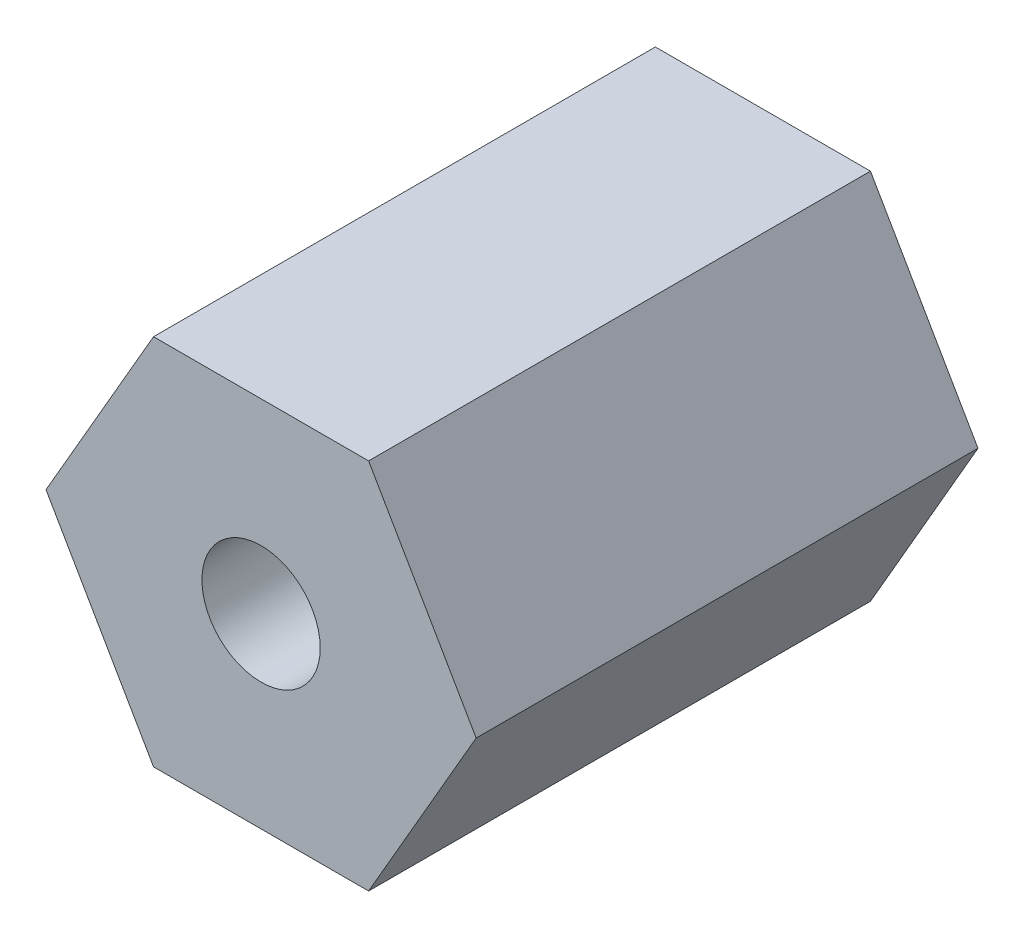
ISO-10303-21;
HEADER;
FILE_DESCRIPTION(('STEP AP214'),'2;1');
FILE_NAME('part.step','',(''),(''),'','','');
FILE_SCHEMA(('AUTOMOTIVE_DESIGN { 1 0 10303 214 1 1 1 1 }'));
ENDSEC;
DATA;
#1=APPLICATION_CONTEXT('core data for automotive mechanical design processes');
#2=APPLICATION_PROTOCOL_DEFINITION('international standard','automotive_design',2000,#1);
#3=PRODUCT_CONTEXT('',#1,'mechanical');
#4=PRODUCT('Part','Part','',(#3));
#5=PRODUCT_RELATED_PRODUCT_CATEGORY('part','',(#4));
#6=PRODUCT_DEFINITION_FORMATION('','',#4);
#7=PRODUCT_DEFINITION_CONTEXT('part definition',#1,'design');
#8=PRODUCT_DEFINITION('design','',#6,#7);
#9=PRODUCT_DEFINITION_SHAPE('','',#8);
#10=(LENGTH_UNIT() NAMED_UNIT(*) SI_UNIT(.MILLI.,.METRE.));
#11=(NAMED_UNIT(*) PLANE_ANGLE_UNIT() SI_UNIT($,.RADIAN.));
#12=(NAMED_UNIT(*) SI_UNIT($,.STERADIAN.) SOLID_ANGLE_UNIT());
#13=UNCERTAINTY_MEASURE_WITH_UNIT(LENGTH_MEASURE(1.E-05),#10,'distance_accuracy_value','');
#14=(GEOMETRIC_REPRESENTATION_CONTEXT(3) GLOBAL_UNCERTAINTY_ASSIGNED_CONTEXT((#13)) GLOBAL_UNIT_ASSIGNED_CONTEXT((#10,
#11,#12)) REPRESENTATION_CONTEXT('',''));
#15=CARTESIAN_POINT('',(0.,0.,0.));
#16=DIRECTION('',(0.,0.,1.));
#17=DIRECTION('',(1.,0.,0.));
#18=AXIS2_PLACEMENT_3D('',#15,#16,#17);
#19=CARTESIAN_POINT('',(3.,5.19615242270663,14.));
#20=DIRECTION('',(0.,-1.,0.));
#21=DIRECTION('',(1.,0.,0.));
#22=AXIS2_PLACEMENT_3D('',#19,#20,#21);
#23=PLANE('',#22);
#24=DIRECTION('',(-1.,0.,0.));
#25=VECTOR('',#24,1.);
#26=CARTESIAN_POINT('',(3.,5.19615242270663,0.));
#27=LINE('',#26,#25);
#28=CARTESIAN_POINT('',(3.,5.19615242270663,0.));
#29=VERTEX_POINT('',#28);
#30=CARTESIAN_POINT('',(-3.,5.19615242270663,0.));
#31=VERTEX_POINT('',#30);
#32=EDGE_CURVE('E122',#29,#31,#27,.T.);
#33=ORIENTED_EDGE('',*,*,#32,.T.);
#34=DIRECTION('',(0.,0.,-1.));
#35=VECTOR('',#34,1.);
#36=CARTESIAN_POINT('',(-3.,5.19615242270663,14.));
#37=LINE('',#36,#35);
#38=CARTESIAN_POINT('',(-3.,5.19615242270663,14.));
#39=VERTEX_POINT('',#38);
#40=EDGE_CURVE('E11',#39,#31,#37,.T.);
#41=ORIENTED_EDGE('',*,*,#40,.F.);
#42=DIRECTION('',(-1.,0.,0.));
#43=VECTOR('',#42,1.);
#44=CARTESIAN_POINT('',(3.,5.19615242270663,14.));
#45=LINE('',#44,#43);
#46=CARTESIAN_POINT('',(3.,5.19615242270663,14.));
#47=VERTEX_POINT('',#46);
#48=EDGE_CURVE('E132',#47,#39,#45,.T.);
#49=ORIENTED_EDGE('',*,*,#48,.F.);
#50=DIRECTION('',(0.,0.,-1.));
#51=VECTOR('',#50,1.);
#52=CARTESIAN_POINT('',(3.,5.19615242270663,14.));
#53=LINE('',#52,#51);
#54=EDGE_CURVE('E118',#47,#29,#53,.T.);
#55=ORIENTED_EDGE('',*,*,#54,.T.);
#56=EDGE_LOOP('',(#33,#41,#49,#55));
#57=FACE_BOUND('',#56,.T.);
#58=ADVANCED_FACE('F37',(#57),#23,.F.);
#59=CARTESIAN_POINT('',(-3.,5.19615242270663,14.));
#60=DIRECTION('',(0.866025403784438,-0.5,0.));
#61=DIRECTION('',(0.5,0.866025403784438,0.));
#62=AXIS2_PLACEMENT_3D('',#59,#60,#61);
#63=PLANE('',#62);
#64=DIRECTION('',(-0.5,-0.866025403784438,0.));
#65=VECTOR('',#64,1.);
#66=CARTESIAN_POINT('',(-3.,5.19615242270663,0.));
#67=LINE('',#66,#65);
#68=CARTESIAN_POINT('',(-6.,0.,0.));
#69=VERTEX_POINT('',#68);
#70=EDGE_CURVE('E125',#31,#69,#67,.T.);
#71=ORIENTED_EDGE('',*,*,#70,.T.);
#72=DIRECTION('',(0.,0.,-1.));
#73=VECTOR('',#72,1.);
#74=CARTESIAN_POINT('',(-6.,0.,14.));
#75=LINE('',#74,#73);
#76=CARTESIAN_POINT('',(-6.,0.,14.));
#77=VERTEX_POINT('',#76);
#78=EDGE_CURVE('E46',#77,#69,#75,.T.);
#79=ORIENTED_EDGE('',*,*,#78,.F.);
#80=DIRECTION('',(-0.5,-0.866025403784438,0.));
#81=VECTOR('',#80,1.);
#82=CARTESIAN_POINT('',(-3.,5.19615242270663,14.));
#83=LINE('',#82,#81);
#84=EDGE_CURVE('E91',#39,#77,#83,.T.);
#85=ORIENTED_EDGE('',*,*,#84,.F.);
#86=ORIENTED_EDGE('',*,*,#40,.T.);
#87=EDGE_LOOP('',(#71,#79,#85,#86));
#88=FACE_BOUND('',#87,.T.);
#89=ADVANCED_FACE('F158',(#88),#63,.F.);
#90=CARTESIAN_POINT('',(-6.,0.,14.));
#91=DIRECTION('',(0.866025403784439,0.5,0.));
#92=DIRECTION('',(-0.5,0.866025403784439,0.));
#93=AXIS2_PLACEMENT_3D('',#90,#91,#92);
#94=PLANE('',#93);
#95=DIRECTION('',(0.5,-0.866025403784439,0.));
#96=VECTOR('',#95,1.);
#97=CARTESIAN_POINT('',(-6.,0.,0.));
#98=LINE('',#97,#96);
#99=CARTESIAN_POINT('',(-3.,-5.19615242270663,0.));
#100=VERTEX_POINT('',#99);
#101=EDGE_CURVE('E127',#69,#100,#98,.T.);
#102=ORIENTED_EDGE('',*,*,#101,.T.);
#103=DIRECTION('',(0.,0.,-1.));
#104=VECTOR('',#103,1.);
#105=CARTESIAN_POINT('',(-3.,-5.19615242270663,14.));
#106=LINE('',#105,#104);
#107=CARTESIAN_POINT('',(-3.,-5.19615242270663,14.));
#108=VERTEX_POINT('',#107);
#109=EDGE_CURVE('E113',#108,#100,#106,.T.);
#110=ORIENTED_EDGE('',*,*,#109,.F.);
#111=DIRECTION('',(0.5,-0.866025403784439,0.));
#112=VECTOR('',#111,1.);
#113=CARTESIAN_POINT('',(-6.,0.,14.));
#114=LINE('',#113,#112);
#115=EDGE_CURVE('E104',#77,#108,#114,.T.);
#116=ORIENTED_EDGE('',*,*,#115,.F.);
#117=ORIENTED_EDGE('',*,*,#78,.T.);
#118=EDGE_LOOP('',(#102,#110,#116,#117));
#119=FACE_BOUND('',#118,.T.);
#120=ADVANCED_FACE('F139',(#119),#94,.F.);
#121=CARTESIAN_POINT('',(-3.,-5.19615242270663,14.));
#122=DIRECTION('',(0.,1.,0.));
#123=DIRECTION('',(0.,0.,1.));
#124=AXIS2_PLACEMENT_3D('',#121,#122,#123);
#125=PLANE('',#124);
#126=DIRECTION('',(1.,0.,0.));
#127=VECTOR('',#126,1.);
#128=CARTESIAN_POINT('',(-3.,-5.19615242270663,0.));
#129=LINE('',#128,#127);
#130=CARTESIAN_POINT('',(3.,-5.19615242270663,0.));
#131=VERTEX_POINT('',#130);
#132=EDGE_CURVE('E112',#100,#131,#129,.T.);
#133=ORIENTED_EDGE('',*,*,#132,.T.);
#134=DIRECTION('',(0.,0.,-1.));
#135=VECTOR('',#134,1.);
#136=CARTESIAN_POINT('',(3.,-5.19615242270663,14.));
#137=LINE('',#136,#135);
#138=CARTESIAN_POINT('',(3.,-5.19615242270663,14.));
#139=VERTEX_POINT('',#138);
#140=EDGE_CURVE('E109',#139,#131,#137,.T.);
#141=ORIENTED_EDGE('',*,*,#140,.F.);
#142=DIRECTION('',(1.,0.,0.));
#143=VECTOR('',#142,1.);
#144=CARTESIAN_POINT('',(-3.,-5.19615242270663,14.));
#145=LINE('',#144,#143);
#146=EDGE_CURVE('E98',#108,#139,#145,.T.);
#147=ORIENTED_EDGE('',*,*,#146,.F.);
#148=ORIENTED_EDGE('',*,*,#109,.T.);
#149=EDGE_LOOP('',(#133,#141,#147,#148));
#150=FACE_BOUND('',#149,.T.);
#151=ADVANCED_FACE('F110',(#150),#125,.F.);
#152=CARTESIAN_POINT('',(3.,-5.19615242270663,14.));
#153=DIRECTION('',(-0.866025403784439,0.5,0.));
#154=DIRECTION('',(-0.5,-0.866025403784439,0.));
#155=AXIS2_PLACEMENT_3D('',#152,#153,#154);
#156=PLANE('',#155);
#157=DIRECTION('',(0.5,0.866025403784439,0.));
#158=VECTOR('',#157,1.);
#159=CARTESIAN_POINT('',(3.,-5.19615242270663,0.));
#160=LINE('',#159,#158);
#161=CARTESIAN_POINT('',(6.,0.,0.));
#162=VERTEX_POINT('',#161);
#163=EDGE_CURVE('E77',#131,#162,#160,.T.);
#164=ORIENTED_EDGE('',*,*,#163,.T.);
#165=DIRECTION('',(0.,0.,-1.));
#166=VECTOR('',#165,1.);
#167=CARTESIAN_POINT('',(6.,0.,14.));
#168=LINE('',#167,#166);
#169=CARTESIAN_POINT('',(6.,0.,14.));
#170=VERTEX_POINT('',#169);
#171=EDGE_CURVE('E114',#170,#162,#168,.T.);
#172=ORIENTED_EDGE('',*,*,#171,.F.);
#173=DIRECTION('',(0.5,0.866025403784439,0.));
#174=VECTOR('',#173,1.);
#175=CARTESIAN_POINT('',(3.,-5.19615242270663,14.));
#176=LINE('',#175,#174);
#177=EDGE_CURVE('E102',#139,#170,#176,.T.);
#178=ORIENTED_EDGE('',*,*,#177,.F.);
#179=ORIENTED_EDGE('',*,*,#140,.T.);
#180=EDGE_LOOP('',(#164,#172,#178,#179));
#181=FACE_BOUND('',#180,.T.);
#182=ADVANCED_FACE('F116',(#181),#156,.F.);
#183=CARTESIAN_POINT('',(6.,0.,14.));
#184=DIRECTION('',(-0.866025403784439,-0.5,0.));
#185=DIRECTION('',(0.5,-0.866025403784439,0.));
#186=AXIS2_PLACEMENT_3D('',#183,#184,#185);
#187=PLANE('',#186);
#188=DIRECTION('',(-0.5,0.866025403784439,0.));
#189=VECTOR('',#188,1.);
#190=CARTESIAN_POINT('',(6.,0.,0.));
#191=LINE('',#190,#189);
#192=EDGE_CURVE('E83',#162,#29,#191,.T.);
#193=ORIENTED_EDGE('',*,*,#192,.T.);
#194=ORIENTED_EDGE('',*,*,#54,.F.);
#195=DIRECTION('',(-0.5,0.866025403784439,0.));
#196=VECTOR('',#195,1.);
#197=CARTESIAN_POINT('',(6.,0.,14.));
#198=LINE('',#197,#196);
#199=EDGE_CURVE('E54',#170,#47,#198,.T.);
#200=ORIENTED_EDGE('',*,*,#199,.F.);
#201=ORIENTED_EDGE('',*,*,#171,.T.);
#202=EDGE_LOOP('',(#193,#194,#200,#201));
#203=FACE_BOUND('',#202,.T.);
#204=ADVANCED_FACE('F146',(#203),#187,.F.);
#205=CARTESIAN_POINT('',(0.,0.,14.));
#206=DIRECTION('',(0.,0.,1.));
#207=DIRECTION('',(1.,0.,0.));
#208=AXIS2_PLACEMENT_3D('',#205,#206,#207);
#209=PLANE('',#208);
#210=CARTESIAN_POINT('',(0.,0.,14.));
#211=DIRECTION('',(0.,0.,1.));
#212=DIRECTION('',(1.,0.,0.));
#213=AXIS2_PLACEMENT_3D('',#210,#211,#212);
#214=CIRCLE('',#213,1.65);
#215=CARTESIAN_POINT('',(1.65,0.,14.));
#216=VERTEX_POINT('',#215);
#217=EDGE_CURVE('E213',#216,#216,#214,.T.);
#218=ORIENTED_EDGE('',*,*,#217,.F.);
#219=EDGE_LOOP('',(#218));
#220=FACE_BOUND('',#219,.T.);
#221=ORIENTED_EDGE('',*,*,#48,.T.);
#222=ORIENTED_EDGE('',*,*,#84,.T.);
#223=ORIENTED_EDGE('',*,*,#115,.T.);
#224=ORIENTED_EDGE('',*,*,#146,.T.);
#225=ORIENTED_EDGE('',*,*,#177,.T.);
#226=ORIENTED_EDGE('',*,*,#199,.T.);
#227=EDGE_LOOP('',(#221,#222,#223,#224,#225,#226));
#228=FACE_BOUND('',#227,.T.);
#229=ADVANCED_FACE('F100',(#220,#228),#209,.T.);
#230=CARTESIAN_POINT('',(0.,0.,0.));
#231=DIRECTION('',(0.,0.,1.));
#232=DIRECTION('',(1.,0.,0.));
#233=AXIS2_PLACEMENT_3D('',#230,#231,#232);
#234=PLANE('',#233);
#235=CARTESIAN_POINT('',(0.,0.,0.));
#236=DIRECTION('',(0.,0.,1.));
#237=DIRECTION('',(1.,0.,0.));
#238=AXIS2_PLACEMENT_3D('',#235,#236,#237);
#239=CIRCLE('',#238,1.65);
#240=CARTESIAN_POINT('',(1.65,0.,0.));
#241=VERTEX_POINT('',#240);
#242=EDGE_CURVE('E40',#241,#241,#239,.T.);
#243=ORIENTED_EDGE('',*,*,#242,.T.);
#244=EDGE_LOOP('',(#243));
#245=FACE_BOUND('',#244,.T.);
#246=ORIENTED_EDGE('',*,*,#32,.F.);
#247=ORIENTED_EDGE('',*,*,#192,.F.);
#248=ORIENTED_EDGE('',*,*,#163,.F.);
#249=ORIENTED_EDGE('',*,*,#132,.F.);
#250=ORIENTED_EDGE('',*,*,#101,.F.);
#251=ORIENTED_EDGE('',*,*,#70,.F.);
#252=EDGE_LOOP('',(#246,#247,#248,#249,#250,#251));
#253=FACE_BOUND('',#252,.T.);
#254=ADVANCED_FACE('F142',(#245,#253),#234,.F.);
#255=CARTESIAN_POINT('',(0.,0.,14.));
#256=DIRECTION('',(0.,0.,1.));
#257=DIRECTION('',(1.,0.,0.));
#258=AXIS2_PLACEMENT_3D('',#255,#256,#257);
#259=CYLINDRICAL_SURFACE('',#258,1.65);
#260=ORIENTED_EDGE('',*,*,#217,.T.);
#261=EDGE_LOOP('',(#260));
#262=FACE_BOUND('',#261,.T.);
#263=ORIENTED_EDGE('',*,*,#242,.F.);
#264=EDGE_LOOP('',(#263));
#265=FACE_BOUND('',#264,.T.);
#266=ADVANCED_FACE('F195',(#262,#265),#259,.F.);
#267=CLOSED_SHELL('',(#58,#89,#120,#151,#182,#204,#229,#254,#266));
#268=MANIFOLD_SOLID_BREP('B2',#267);
#269=ADVANCED_BREP_SHAPE_REPRESENTATION('',(#18,#268),#14);
#270=SHAPE_DEFINITION_REPRESENTATION(#9,#269);
ENDSEC;
END-ISO-10303-21;
